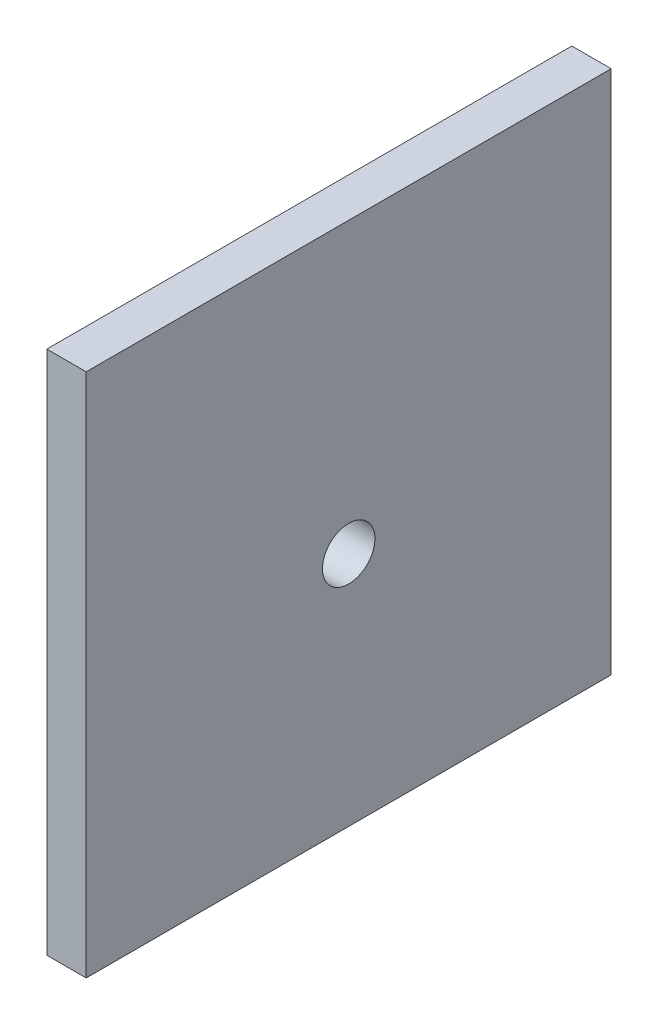
ISO-10303-21;
HEADER;
FILE_DESCRIPTION(('STEP AP214'),'2;1');
FILE_NAME('part.step','',(''),(''),'','','');
FILE_SCHEMA(('AUTOMOTIVE_DESIGN { 1 0 10303 214 1 1 1 1 }'));
ENDSEC;
DATA;
#1=APPLICATION_CONTEXT('core data for automotive mechanical design processes');
#2=APPLICATION_PROTOCOL_DEFINITION('international standard','automotive_design',2000,#1);
#3=PRODUCT_CONTEXT('',#1,'mechanical');
#4=PRODUCT('Part','Part','',(#3));
#5=PRODUCT_RELATED_PRODUCT_CATEGORY('part','',(#4));
#6=PRODUCT_DEFINITION_FORMATION('','',#4);
#7=PRODUCT_DEFINITION_CONTEXT('part definition',#1,'design');
#8=PRODUCT_DEFINITION('design','',#6,#7);
#9=PRODUCT_DEFINITION_SHAPE('','',#8);
#10=(LENGTH_UNIT() NAMED_UNIT(*) SI_UNIT(.MILLI.,.METRE.));
#11=(NAMED_UNIT(*) PLANE_ANGLE_UNIT() SI_UNIT($,.RADIAN.));
#12=(NAMED_UNIT(*) SI_UNIT($,.STERADIAN.) SOLID_ANGLE_UNIT());
#13=UNCERTAINTY_MEASURE_WITH_UNIT(LENGTH_MEASURE(1.E-05),#10,'distance_accuracy_value','');
#14=(GEOMETRIC_REPRESENTATION_CONTEXT(3) GLOBAL_UNCERTAINTY_ASSIGNED_CONTEXT((#13)) GLOBAL_UNIT_ASSIGNED_CONTEXT((#10,
#11,#12)) REPRESENTATION_CONTEXT('',''));
#15=CARTESIAN_POINT('',(0.,0.,0.));
#16=DIRECTION('',(0.,0.,1.));
#17=DIRECTION('',(1.,0.,0.));
#18=AXIS2_PLACEMENT_3D('',#15,#16,#17);
#19=CARTESIAN_POINT('',(3.,0.,0.));
#20=DIRECTION('',(-1.,0.,0.));
#21=DIRECTION('',(0.,0.,1.));
#22=AXIS2_PLACEMENT_3D('',#19,#20,#21);
#23=PLANE('',#22);
#24=DIRECTION('',(0.,-1.,0.));
#25=VECTOR('',#24,1.);
#26=CARTESIAN_POINT('',(3.,-32.1973012921568,31.2692457590579));
#27=LINE('',#26,#25);
#28=CARTESIAN_POINT('',(3.,7.80269870784321,31.2692457590579));
#29=VERTEX_POINT('',#28);
#30=CARTESIAN_POINT('',(3.,-32.1973012921568,31.2692457590579));
#31=VERTEX_POINT('',#30);
#32=EDGE_CURVE('E84',#29,#31,#27,.T.);
#33=ORIENTED_EDGE('',*,*,#32,.T.);
#34=DIRECTION('',(0.,0.,-1.));
#35=VECTOR('',#34,1.);
#36=CARTESIAN_POINT('',(3.,-32.1973012921568,-8.73075424094205));
#37=LINE('',#36,#35);
#38=CARTESIAN_POINT('',(3.,-32.1973012921568,-8.73075424094205));
#39=VERTEX_POINT('',#38);
#40=EDGE_CURVE('E79',#31,#39,#37,.T.);
#41=ORIENTED_EDGE('',*,*,#40,.T.);
#42=DIRECTION('',(0.,1.,0.));
#43=VECTOR('',#42,1.);
#44=CARTESIAN_POINT('',(3.,7.80269870784321,-8.73075424094205));
#45=LINE('',#44,#43);
#46=CARTESIAN_POINT('',(3.,7.80269870784321,-8.73075424094205));
#47=VERTEX_POINT('',#46);
#48=EDGE_CURVE('E82',#39,#47,#45,.T.);
#49=ORIENTED_EDGE('',*,*,#48,.T.);
#50=DIRECTION('',(0.,0.,1.));
#51=VECTOR('',#50,1.);
#52=CARTESIAN_POINT('',(3.,7.80269870784321,31.2692457590579));
#53=LINE('',#52,#51);
#54=EDGE_CURVE('E49',#47,#29,#53,.T.);
#55=ORIENTED_EDGE('',*,*,#54,.T.);
#56=EDGE_LOOP('',(#33,#41,#49,#55));
#57=FACE_BOUND('',#56,.T.);
#58=CARTESIAN_POINT('',(3.,-14.1973012921568,11.269245759058));
#59=DIRECTION('',(1.,0.,0.));
#60=DIRECTION('',(0.,0.,-1.));
#61=AXIS2_PLACEMENT_3D('',#58,#59,#60);
#62=CIRCLE('',#61,2.);
#63=CARTESIAN_POINT('',(3.,-14.1973012921568,9.26924575905797));
#64=VERTEX_POINT('',#63);
#65=EDGE_CURVE('E99',#64,#64,#62,.T.);
#66=ORIENTED_EDGE('',*,*,#65,.F.);
#67=EDGE_LOOP('',(#66));
#68=FACE_BOUND('',#67,.T.);
#69=ADVANCED_FACE('F32',(#57,#68),#23,.F.);
#70=CARTESIAN_POINT('',(0.,0.,0.));
#71=DIRECTION('',(-1.,0.,0.));
#72=DIRECTION('',(0.,0.,1.));
#73=AXIS2_PLACEMENT_3D('',#70,#71,#72);
#74=PLANE('',#73);
#75=DIRECTION('',(0.,-1.,0.));
#76=VECTOR('',#75,1.);
#77=CARTESIAN_POINT('',(0.,-32.1973012921568,31.2692457590579));
#78=LINE('',#77,#76);
#79=CARTESIAN_POINT('',(0.,7.80269870784321,31.2692457590579));
#80=VERTEX_POINT('',#79);
#81=CARTESIAN_POINT('',(0.,-32.1973012921568,31.2692457590579));
#82=VERTEX_POINT('',#81);
#83=EDGE_CURVE('E96',#80,#82,#78,.T.);
#84=ORIENTED_EDGE('',*,*,#83,.F.);
#85=DIRECTION('',(0.,0.,1.));
#86=VECTOR('',#85,1.);
#87=CARTESIAN_POINT('',(0.,7.80269870784321,31.2692457590579));
#88=LINE('',#87,#86);
#89=CARTESIAN_POINT('',(0.,7.80269870784321,-8.73075424094205));
#90=VERTEX_POINT('',#89);
#91=EDGE_CURVE('E72',#90,#80,#88,.T.);
#92=ORIENTED_EDGE('',*,*,#91,.F.);
#93=DIRECTION('',(0.,1.,0.));
#94=VECTOR('',#93,1.);
#95=CARTESIAN_POINT('',(0.,7.80269870784321,-8.73075424094205));
#96=LINE('',#95,#94);
#97=CARTESIAN_POINT('',(0.,-32.1973012921568,-8.73075424094205));
#98=VERTEX_POINT('',#97);
#99=EDGE_CURVE('E66',#98,#90,#96,.T.);
#100=ORIENTED_EDGE('',*,*,#99,.F.);
#101=DIRECTION('',(0.,0.,-1.));
#102=VECTOR('',#101,1.);
#103=CARTESIAN_POINT('',(0.,-32.1973012921568,-8.73075424094205));
#104=LINE('',#103,#102);
#105=EDGE_CURVE('E88',#82,#98,#104,.T.);
#106=ORIENTED_EDGE('',*,*,#105,.F.);
#107=EDGE_LOOP('',(#84,#92,#100,#106));
#108=FACE_BOUND('',#107,.T.);
#109=CARTESIAN_POINT('',(0.,-14.1973012921568,11.269245759058));
#110=DIRECTION('',(1.,0.,0.));
#111=DIRECTION('',(0.,0.,-1.));
#112=AXIS2_PLACEMENT_3D('',#109,#110,#111);
#113=CIRCLE('',#112,2.);
#114=CARTESIAN_POINT('',(0.,-14.1973012921568,9.26924575905797));
#115=VERTEX_POINT('',#114);
#116=EDGE_CURVE('E111',#115,#115,#113,.T.);
#117=ORIENTED_EDGE('',*,*,#116,.T.);
#118=EDGE_LOOP('',(#117));
#119=FACE_BOUND('',#118,.T.);
#120=ADVANCED_FACE('F107',(#108,#119),#74,.T.);
#121=CARTESIAN_POINT('',(3.,-32.1973012921568,31.2692457590579));
#122=DIRECTION('',(0.,0.,-1.));
#123=DIRECTION('',(-1.,0.,0.));
#124=AXIS2_PLACEMENT_3D('',#121,#122,#123);
#125=PLANE('',#124);
#126=ORIENTED_EDGE('',*,*,#83,.T.);
#127=DIRECTION('',(-1.,0.,0.));
#128=VECTOR('',#127,1.);
#129=CARTESIAN_POINT('',(3.,-32.1973012921568,31.2692457590579));
#130=LINE('',#129,#128);
#131=EDGE_CURVE('E11',#31,#82,#130,.T.);
#132=ORIENTED_EDGE('',*,*,#131,.F.);
#133=ORIENTED_EDGE('',*,*,#32,.F.);
#134=DIRECTION('',(-1.,0.,0.));
#135=VECTOR('',#134,1.);
#136=CARTESIAN_POINT('',(3.,7.80269870784321,31.2692457590579));
#137=LINE('',#136,#135);
#138=EDGE_CURVE('E92',#29,#80,#137,.T.);
#139=ORIENTED_EDGE('',*,*,#138,.T.);
#140=EDGE_LOOP('',(#126,#132,#133,#139));
#141=FACE_BOUND('',#140,.T.);
#142=ADVANCED_FACE('F34',(#141),#125,.F.);
#143=CARTESIAN_POINT('',(3.,-32.1973012921568,-8.73075424094205));
#144=DIRECTION('',(0.,1.,0.));
#145=DIRECTION('',(0.,0.,1.));
#146=AXIS2_PLACEMENT_3D('',#143,#144,#145);
#147=PLANE('',#146);
#148=ORIENTED_EDGE('',*,*,#105,.T.);
#149=DIRECTION('',(-1.,0.,0.));
#150=VECTOR('',#149,1.);
#151=CARTESIAN_POINT('',(3.,-32.1973012921568,-8.73075424094205));
#152=LINE('',#151,#150);
#153=EDGE_CURVE('E41',#39,#98,#152,.T.);
#154=ORIENTED_EDGE('',*,*,#153,.F.);
#155=ORIENTED_EDGE('',*,*,#40,.F.);
#156=ORIENTED_EDGE('',*,*,#131,.T.);
#157=EDGE_LOOP('',(#148,#154,#155,#156));
#158=FACE_BOUND('',#157,.T.);
#159=ADVANCED_FACE('F87',(#158),#147,.F.);
#160=CARTESIAN_POINT('',(3.,7.80269870784321,-8.73075424094205));
#161=DIRECTION('',(0.,0.,1.));
#162=DIRECTION('',(1.,0.,0.));
#163=AXIS2_PLACEMENT_3D('',#160,#161,#162);
#164=PLANE('',#163);
#165=ORIENTED_EDGE('',*,*,#99,.T.);
#166=DIRECTION('',(-1.,0.,0.));
#167=VECTOR('',#166,1.);
#168=CARTESIAN_POINT('',(3.,7.80269870784321,-8.73075424094205));
#169=LINE('',#168,#167);
#170=EDGE_CURVE('E89',#47,#90,#169,.T.);
#171=ORIENTED_EDGE('',*,*,#170,.F.);
#172=ORIENTED_EDGE('',*,*,#48,.F.);
#173=ORIENTED_EDGE('',*,*,#153,.T.);
#174=EDGE_LOOP('',(#165,#171,#172,#173));
#175=FACE_BOUND('',#174,.T.);
#176=ADVANCED_FACE('F90',(#175),#164,.F.);
#177=CARTESIAN_POINT('',(3.,7.80269870784321,31.2692457590579));
#178=DIRECTION('',(0.,-1.,0.));
#179=DIRECTION('',(0.,0.,-1.));
#180=AXIS2_PLACEMENT_3D('',#177,#178,#179);
#181=PLANE('',#180);
#182=ORIENTED_EDGE('',*,*,#91,.T.);
#183=ORIENTED_EDGE('',*,*,#138,.F.);
#184=ORIENTED_EDGE('',*,*,#54,.F.);
#185=ORIENTED_EDGE('',*,*,#170,.T.);
#186=EDGE_LOOP('',(#182,#183,#184,#185));
#187=FACE_BOUND('',#186,.T.);
#188=ADVANCED_FACE('F104',(#187),#181,.F.);
#189=CARTESIAN_POINT('',(3.,-14.1973012921568,11.269245759058));
#190=DIRECTION('',(-1.,0.,0.));
#191=DIRECTION('',(0.,0.,1.));
#192=AXIS2_PLACEMENT_3D('',#189,#190,#191);
#193=CYLINDRICAL_SURFACE('',#192,2.);
#194=ORIENTED_EDGE('',*,*,#65,.T.);
#195=EDGE_LOOP('',(#194));
#196=FACE_BOUND('',#195,.T.);
#197=ORIENTED_EDGE('',*,*,#116,.F.);
#198=EDGE_LOOP('',(#197));
#199=FACE_BOUND('',#198,.T.);
#200=ADVANCED_FACE('F117',(#196,#199),#193,.F.);
#201=CLOSED_SHELL('',(#69,#120,#142,#159,#176,#188,#200));
#202=MANIFOLD_SOLID_BREP('B2',#201);
#203=ADVANCED_BREP_SHAPE_REPRESENTATION('',(#18,#202),#14);
#204=SHAPE_DEFINITION_REPRESENTATION(#9,#203);
ENDSEC;
END-ISO-10303-21;
